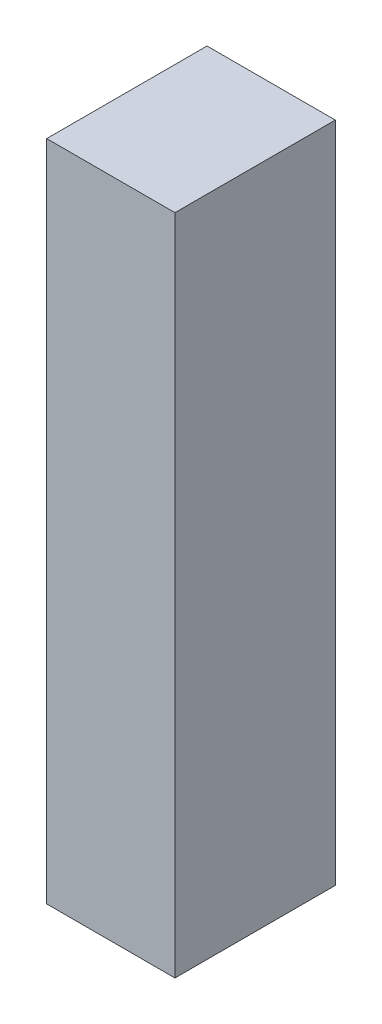
ISO-10303-21;
HEADER;
FILE_DESCRIPTION(('STEP AP214'),'2;1');
FILE_NAME('part.step','',(''),(''),'','','');
FILE_SCHEMA(('AUTOMOTIVE_DESIGN { 1 0 10303 214 1 1 1 1 }'));
ENDSEC;
DATA;
#1=APPLICATION_CONTEXT('core data for automotive mechanical design processes');
#2=APPLICATION_PROTOCOL_DEFINITION('international standard','automotive_design',2000,#1);
#3=PRODUCT_CONTEXT('',#1,'mechanical');
#4=PRODUCT('Part','Part','',(#3));
#5=PRODUCT_RELATED_PRODUCT_CATEGORY('part','',(#4));
#6=PRODUCT_DEFINITION_FORMATION('','',#4);
#7=PRODUCT_DEFINITION_CONTEXT('part definition',#1,'design');
#8=PRODUCT_DEFINITION('design','',#6,#7);
#9=PRODUCT_DEFINITION_SHAPE('','',#8);
#10=(LENGTH_UNIT() NAMED_UNIT(*) SI_UNIT(.MILLI.,.METRE.));
#11=(NAMED_UNIT(*) PLANE_ANGLE_UNIT() SI_UNIT($,.RADIAN.));
#12=(NAMED_UNIT(*) SI_UNIT($,.STERADIAN.) SOLID_ANGLE_UNIT());
#13=UNCERTAINTY_MEASURE_WITH_UNIT(LENGTH_MEASURE(1.E-05),#10,'distance_accuracy_value','');
#14=(GEOMETRIC_REPRESENTATION_CONTEXT(3) GLOBAL_UNCERTAINTY_ASSIGNED_CONTEXT((#13)) GLOBAL_UNIT_ASSIGNED_CONTEXT((#10,
#11,#12)) REPRESENTATION_CONTEXT('',''));
#15=CARTESIAN_POINT('',(0.,0.,0.));
#16=DIRECTION('',(0.,0.,1.));
#17=DIRECTION('',(1.,0.,0.));
#18=AXIS2_PLACEMENT_3D('',#15,#16,#17);
#19=CARTESIAN_POINT('',(0.,0.,0.));
#20=DIRECTION('',(1.,0.,0.));
#21=DIRECTION('',(0.,0.,1.));
#22=AXIS2_PLACEMENT_3D('',#19,#20,#21);
#23=PLANE('',#22);
#24=DIRECTION('',(0.,1.,0.));
#25=VECTOR('',#24,1.);
#26=CARTESIAN_POINT('',(0.,0.,0.75));
#27=LINE('',#26,#25);
#28=CARTESIAN_POINT('',(0.,0.,0.75));
#29=VERTEX_POINT('',#28);
#30=CARTESIAN_POINT('',(0.,3.1,0.75));
#31=VERTEX_POINT('',#30);
#32=EDGE_CURVE('E11',#29,#31,#27,.T.);
#33=ORIENTED_EDGE('',*,*,#32,.T.);
#34=DIRECTION('',(0.,0.,1.));
#35=VECTOR('',#34,1.);
#36=CARTESIAN_POINT('',(0.,3.1,0.));
#37=LINE('',#36,#35);
#38=CARTESIAN_POINT('',(0.,3.1,0.));
#39=VERTEX_POINT('',#38);
#40=EDGE_CURVE('E24',#39,#31,#37,.T.);
#41=ORIENTED_EDGE('',*,*,#40,.F.);
#42=DIRECTION('',(0.,1.,0.));
#43=VECTOR('',#42,1.);
#44=CARTESIAN_POINT('',(0.,0.,0.));
#45=LINE('',#44,#43);
#46=CARTESIAN_POINT('',(0.,0.,0.));
#47=VERTEX_POINT('',#46);
#48=EDGE_CURVE('E86',#47,#39,#45,.T.);
#49=ORIENTED_EDGE('',*,*,#48,.F.);
#50=DIRECTION('',(0.,0.,1.));
#51=VECTOR('',#50,1.);
#52=CARTESIAN_POINT('',(0.,0.,0.));
#53=LINE('',#52,#51);
#54=EDGE_CURVE('E36',#47,#29,#53,.T.);
#55=ORIENTED_EDGE('',*,*,#54,.T.);
#56=EDGE_LOOP('',(#33,#41,#49,#55));
#57=FACE_BOUND('',#56,.T.);
#58=ADVANCED_FACE('F17',(#57),#23,.F.);
#59=CARTESIAN_POINT('',(0.6,0.,0.));
#60=DIRECTION('',(1.,0.,0.));
#61=DIRECTION('',(0.,0.,1.));
#62=AXIS2_PLACEMENT_3D('',#59,#60,#61);
#63=PLANE('',#62);
#64=DIRECTION('',(0.,0.,1.));
#65=VECTOR('',#64,1.);
#66=CARTESIAN_POINT('',(0.6,0.,0.));
#67=LINE('',#66,#65);
#68=CARTESIAN_POINT('',(0.6,0.,0.));
#69=VERTEX_POINT('',#68);
#70=CARTESIAN_POINT('',(0.6,0.,0.75));
#71=VERTEX_POINT('',#70);
#72=EDGE_CURVE('E83',#69,#71,#67,.T.);
#73=ORIENTED_EDGE('',*,*,#72,.F.);
#74=DIRECTION('',(0.,1.,0.));
#75=VECTOR('',#74,1.);
#76=CARTESIAN_POINT('',(0.6,0.,0.));
#77=LINE('',#76,#75);
#78=CARTESIAN_POINT('',(0.6,3.1,0.));
#79=VERTEX_POINT('',#78);
#80=EDGE_CURVE('E63',#69,#79,#77,.T.);
#81=ORIENTED_EDGE('',*,*,#80,.T.);
#82=DIRECTION('',(0.,0.,1.));
#83=VECTOR('',#82,1.);
#84=CARTESIAN_POINT('',(0.6,3.1,0.));
#85=LINE('',#84,#83);
#86=CARTESIAN_POINT('',(0.6,3.1,0.75));
#87=VERTEX_POINT('',#86);
#88=EDGE_CURVE('E57',#79,#87,#85,.T.);
#89=ORIENTED_EDGE('',*,*,#88,.T.);
#90=DIRECTION('',(0.,1.,0.));
#91=VECTOR('',#90,1.);
#92=CARTESIAN_POINT('',(0.6,0.,0.75));
#93=LINE('',#92,#91);
#94=EDGE_CURVE('E60',#71,#87,#93,.T.);
#95=ORIENTED_EDGE('',*,*,#94,.F.);
#96=EDGE_LOOP('',(#73,#81,#89,#95));
#97=FACE_BOUND('',#96,.T.);
#98=ADVANCED_FACE('F59',(#97),#63,.T.);
#99=CARTESIAN_POINT('',(0.,0.,0.));
#100=DIRECTION('',(0.,1.,0.));
#101=DIRECTION('',(0.,0.,1.));
#102=AXIS2_PLACEMENT_3D('',#99,#100,#101);
#103=PLANE('',#102);
#104=ORIENTED_EDGE('',*,*,#72,.T.);
#105=DIRECTION('',(1.,0.,0.));
#106=VECTOR('',#105,1.);
#107=CARTESIAN_POINT('',(0.,0.,0.75));
#108=LINE('',#107,#106);
#109=EDGE_CURVE('E71',#29,#71,#108,.T.);
#110=ORIENTED_EDGE('',*,*,#109,.F.);
#111=ORIENTED_EDGE('',*,*,#54,.F.);
#112=DIRECTION('',(1.,0.,0.));
#113=VECTOR('',#112,1.);
#114=CARTESIAN_POINT('',(0.,0.,0.));
#115=LINE('',#114,#113);
#116=EDGE_CURVE('E76',#47,#69,#115,.T.);
#117=ORIENTED_EDGE('',*,*,#116,.T.);
#118=EDGE_LOOP('',(#104,#110,#111,#117));
#119=FACE_BOUND('',#118,.T.);
#120=ADVANCED_FACE('F91',(#119),#103,.F.);
#121=CARTESIAN_POINT('',(0.,3.1,0.));
#122=DIRECTION('',(0.,1.,0.));
#123=DIRECTION('',(0.,0.,1.));
#124=AXIS2_PLACEMENT_3D('',#121,#122,#123);
#125=PLANE('',#124);
#126=DIRECTION('',(1.,0.,0.));
#127=VECTOR('',#126,1.);
#128=CARTESIAN_POINT('',(0.,3.1,0.));
#129=LINE('',#128,#127);
#130=EDGE_CURVE('E74',#39,#79,#129,.T.);
#131=ORIENTED_EDGE('',*,*,#130,.F.);
#132=ORIENTED_EDGE('',*,*,#40,.T.);
#133=DIRECTION('',(1.,0.,0.));
#134=VECTOR('',#133,1.);
#135=CARTESIAN_POINT('',(0.,3.1,0.75));
#136=LINE('',#135,#134);
#137=EDGE_CURVE('E69',#31,#87,#136,.T.);
#138=ORIENTED_EDGE('',*,*,#137,.T.);
#139=ORIENTED_EDGE('',*,*,#88,.F.);
#140=EDGE_LOOP('',(#131,#132,#138,#139));
#141=FACE_BOUND('',#140,.T.);
#142=ADVANCED_FACE('F73',(#141),#125,.T.);
#143=CARTESIAN_POINT('',(0.,0.,0.));
#144=DIRECTION('',(0.,0.,1.));
#145=DIRECTION('',(1.,0.,0.));
#146=AXIS2_PLACEMENT_3D('',#143,#144,#145);
#147=PLANE('',#146);
#148=ORIENTED_EDGE('',*,*,#130,.T.);
#149=ORIENTED_EDGE('',*,*,#80,.F.);
#150=ORIENTED_EDGE('',*,*,#116,.F.);
#151=ORIENTED_EDGE('',*,*,#48,.T.);
#152=EDGE_LOOP('',(#148,#149,#150,#151));
#153=FACE_BOUND('',#152,.T.);
#154=ADVANCED_FACE('F89',(#153),#147,.F.);
#155=CARTESIAN_POINT('',(0.,0.,0.75));
#156=DIRECTION('',(0.,0.,1.));
#157=DIRECTION('',(1.,0.,0.));
#158=AXIS2_PLACEMENT_3D('',#155,#156,#157);
#159=PLANE('',#158);
#160=ORIENTED_EDGE('',*,*,#32,.F.);
#161=ORIENTED_EDGE('',*,*,#109,.T.);
#162=ORIENTED_EDGE('',*,*,#94,.T.);
#163=ORIENTED_EDGE('',*,*,#137,.F.);
#164=EDGE_LOOP('',(#160,#161,#162,#163));
#165=FACE_BOUND('',#164,.T.);
#166=ADVANCED_FACE('F68',(#165),#159,.T.);
#167=CLOSED_SHELL('',(#58,#98,#120,#142,#154,#166));
#168=MANIFOLD_SOLID_BREP('B1',#167);
#169=ADVANCED_BREP_SHAPE_REPRESENTATION('',(#18,#168),#14);
#170=SHAPE_DEFINITION_REPRESENTATION(#9,#169);
ENDSEC;
END-ISO-10303-21;
